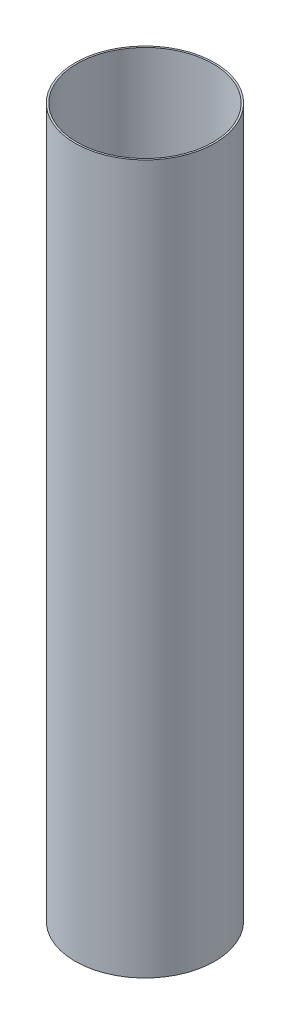
ISO-10303-21;
HEADER;
FILE_DESCRIPTION(('STEP AP214'),'2;1');
FILE_NAME('part.step','',(''),(''),'','','');
FILE_SCHEMA(('AUTOMOTIVE_DESIGN { 1 0 10303 214 1 1 1 1 }'));
ENDSEC;
DATA;
#1=APPLICATION_CONTEXT('core data for automotive mechanical design processes');
#2=APPLICATION_PROTOCOL_DEFINITION('international standard','automotive_design',2000,#1);
#3=PRODUCT_CONTEXT('',#1,'mechanical');
#4=PRODUCT('Part','Part','',(#3));
#5=PRODUCT_RELATED_PRODUCT_CATEGORY('part','',(#4));
#6=PRODUCT_DEFINITION_FORMATION('','',#4);
#7=PRODUCT_DEFINITION_CONTEXT('part definition',#1,'design');
#8=PRODUCT_DEFINITION('design','',#6,#7);
#9=PRODUCT_DEFINITION_SHAPE('','',#8);
#10=(LENGTH_UNIT() NAMED_UNIT(*) SI_UNIT(.MILLI.,.METRE.));
#11=(NAMED_UNIT(*) PLANE_ANGLE_UNIT() SI_UNIT($,.RADIAN.));
#12=(NAMED_UNIT(*) SI_UNIT($,.STERADIAN.) SOLID_ANGLE_UNIT());
#13=UNCERTAINTY_MEASURE_WITH_UNIT(LENGTH_MEASURE(1.E-05),#10,'distance_accuracy_value','');
#14=(GEOMETRIC_REPRESENTATION_CONTEXT(3) GLOBAL_UNCERTAINTY_ASSIGNED_CONTEXT((#13)) GLOBAL_UNIT_ASSIGNED_CONTEXT((#10,
#11,#12)) REPRESENTATION_CONTEXT('',''));
#15=CARTESIAN_POINT('',(0.,0.,0.));
#16=DIRECTION('',(0.,0.,1.));
#17=DIRECTION('',(1.,0.,0.));
#18=AXIS2_PLACEMENT_3D('',#15,#16,#17);
#19=CARTESIAN_POINT('',(0.,203.,0.));
#20=DIRECTION('',(0.,1.,0.));
#21=DIRECTION('',(0.,0.,1.));
#22=AXIS2_PLACEMENT_3D('',#19,#20,#21);
#23=PLANE('',#22);
#24=CARTESIAN_POINT('',(0.,203.,0.));
#25=DIRECTION('',(0.,1.,0.));
#26=DIRECTION('',(0.,0.,1.));
#27=AXIS2_PLACEMENT_3D('',#24,#25,#26);
#28=CIRCLE('',#27,20.);
#29=CARTESIAN_POINT('',(0.,203.,20.));
#30=VERTEX_POINT('',#29);
#31=EDGE_CURVE('E10',#30,#30,#28,.T.);
#32=ORIENTED_EDGE('',*,*,#31,.T.);
#33=EDGE_LOOP('',(#32));
#34=FACE_BOUND('',#33,.T.);
#35=CARTESIAN_POINT('',(0.,203.,0.));
#36=DIRECTION('',(0.,1.,0.));
#37=DIRECTION('',(0.,0.,1.));
#38=AXIS2_PLACEMENT_3D('',#35,#36,#37);
#39=CIRCLE('',#38,19.5);
#40=CARTESIAN_POINT('',(0.,203.,19.5));
#41=VERTEX_POINT('',#40);
#42=EDGE_CURVE('E52',#41,#41,#39,.T.);
#43=ORIENTED_EDGE('',*,*,#42,.F.);
#44=EDGE_LOOP('',(#43));
#45=FACE_BOUND('',#44,.T.);
#46=ADVANCED_FACE('F41',(#34,#45),#23,.T.);
#47=CARTESIAN_POINT('',(0.,0.,0.));
#48=DIRECTION('',(0.,1.,0.));
#49=DIRECTION('',(0.,0.,1.));
#50=AXIS2_PLACEMENT_3D('',#47,#48,#49);
#51=PLANE('',#50);
#52=CARTESIAN_POINT('',(0.,0.,0.));
#53=DIRECTION('',(0.,1.,0.));
#54=DIRECTION('',(0.,0.,1.));
#55=AXIS2_PLACEMENT_3D('',#52,#53,#54);
#56=CIRCLE('',#55,20.);
#57=CARTESIAN_POINT('',(0.,0.,20.));
#58=VERTEX_POINT('',#57);
#59=EDGE_CURVE('E45',#58,#58,#56,.T.);
#60=ORIENTED_EDGE('',*,*,#59,.F.);
#61=EDGE_LOOP('',(#60));
#62=FACE_BOUND('',#61,.T.);
#63=CARTESIAN_POINT('',(0.,0.,0.));
#64=DIRECTION('',(0.,1.,0.));
#65=DIRECTION('',(0.,0.,1.));
#66=AXIS2_PLACEMENT_3D('',#63,#64,#65);
#67=CIRCLE('',#66,19.5);
#68=CARTESIAN_POINT('',(0.,0.,19.5));
#69=VERTEX_POINT('',#68);
#70=EDGE_CURVE('E54',#69,#69,#67,.T.);
#71=ORIENTED_EDGE('',*,*,#70,.T.);
#72=EDGE_LOOP('',(#71));
#73=FACE_BOUND('',#72,.T.);
#74=ADVANCED_FACE('F64',(#62,#73),#51,.F.);
#75=CARTESIAN_POINT('',(0.,203.,0.));
#76=DIRECTION('',(0.,-1.,0.));
#77=DIRECTION('',(0.,0.,-1.));
#78=AXIS2_PLACEMENT_3D('',#75,#76,#77);
#79=CYLINDRICAL_SURFACE('',#78,20.);
#80=ORIENTED_EDGE('',*,*,#31,.F.);
#81=EDGE_LOOP('',(#80));
#82=FACE_BOUND('',#81,.T.);
#83=ORIENTED_EDGE('',*,*,#59,.T.);
#84=EDGE_LOOP('',(#83));
#85=FACE_BOUND('',#84,.T.);
#86=ADVANCED_FACE('F43',(#82,#85),#79,.T.);
#87=CARTESIAN_POINT('',(0.,203.,0.));
#88=DIRECTION('',(0.,-1.,0.));
#89=DIRECTION('',(0.,0.,-1.));
#90=AXIS2_PLACEMENT_3D('',#87,#88,#89);
#91=CYLINDRICAL_SURFACE('',#90,19.5);
#92=ORIENTED_EDGE('',*,*,#42,.T.);
#93=EDGE_LOOP('',(#92));
#94=FACE_BOUND('',#93,.T.);
#95=ORIENTED_EDGE('',*,*,#70,.F.);
#96=EDGE_LOOP('',(#95));
#97=FACE_BOUND('',#96,.T.);
#98=ADVANCED_FACE('F60',(#94,#97),#91,.F.);
#99=CLOSED_SHELL('',(#46,#74,#86,#98));
#100=MANIFOLD_SOLID_BREP('B2',#99);
#101=ADVANCED_BREP_SHAPE_REPRESENTATION('',(#18,#100),#14);
#102=SHAPE_DEFINITION_REPRESENTATION(#9,#101);
ENDSEC;
END-ISO-10303-21;
